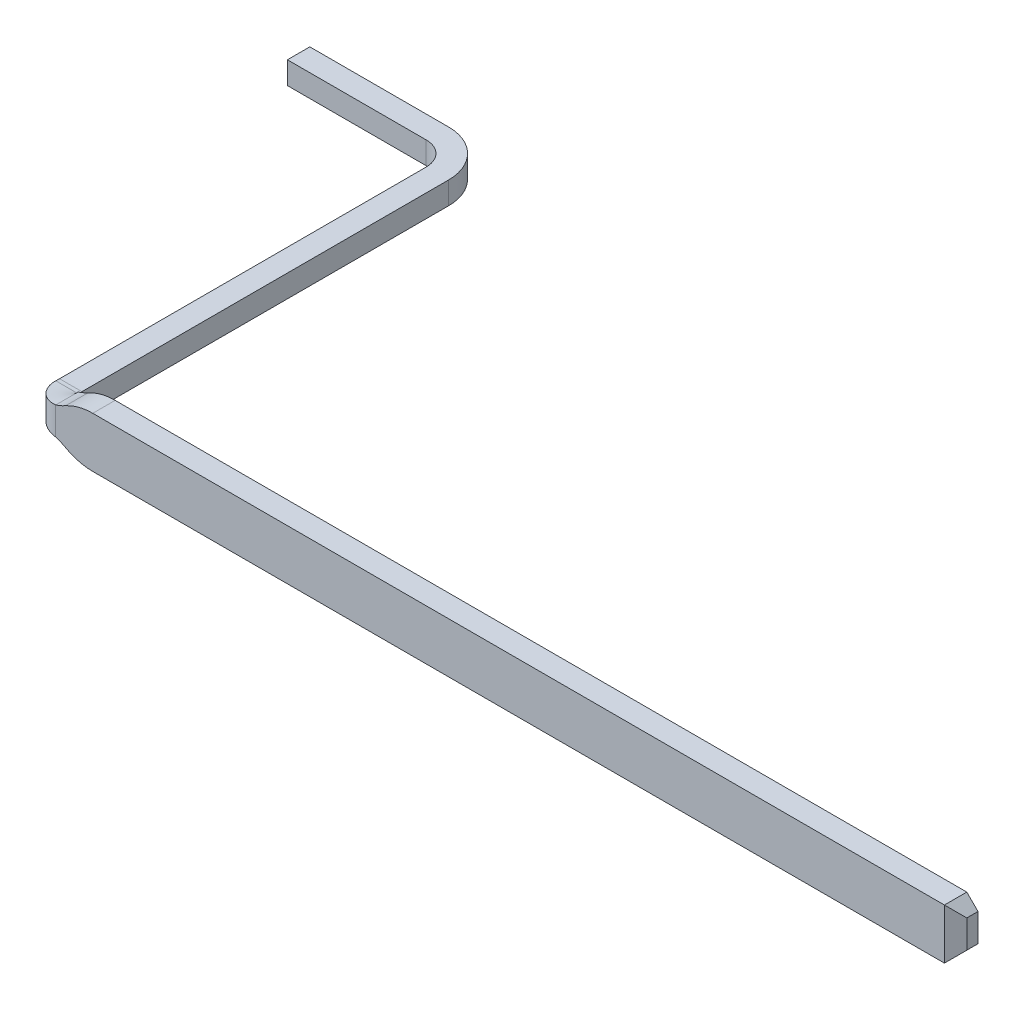
ISO-10303-21;
HEADER;
FILE_DESCRIPTION(('STEP AP214'),'2;1');
FILE_NAME('part.step','',(''),(''),'','','');
FILE_SCHEMA(('AUTOMOTIVE_DESIGN { 1 0 10303 214 1 1 1 1 }'));
ENDSEC;
DATA;
#1=APPLICATION_CONTEXT('core data for automotive mechanical design processes');
#2=APPLICATION_PROTOCOL_DEFINITION('international standard','automotive_design',2000,#1);
#3=PRODUCT_CONTEXT('',#1,'mechanical');
#4=PRODUCT('Part','Part','',(#3));
#5=PRODUCT_RELATED_PRODUCT_CATEGORY('part','',(#4));
#6=PRODUCT_DEFINITION_FORMATION('','',#4);
#7=PRODUCT_DEFINITION_CONTEXT('part definition',#1,'design');
#8=PRODUCT_DEFINITION('design','',#6,#7);
#9=PRODUCT_DEFINITION_SHAPE('','',#8);
#10=(LENGTH_UNIT() NAMED_UNIT(*) SI_UNIT(.MILLI.,.METRE.));
#11=(NAMED_UNIT(*) PLANE_ANGLE_UNIT() SI_UNIT($,.RADIAN.));
#12=(NAMED_UNIT(*) SI_UNIT($,.STERADIAN.) SOLID_ANGLE_UNIT());
#13=UNCERTAINTY_MEASURE_WITH_UNIT(LENGTH_MEASURE(1.E-05),#10,'distance_accuracy_value','');
#14=(GEOMETRIC_REPRESENTATION_CONTEXT(3) GLOBAL_UNCERTAINTY_ASSIGNED_CONTEXT((#13)) GLOBAL_UNIT_ASSIGNED_CONTEXT((#10,
#11,#12)) REPRESENTATION_CONTEXT('',''));
#15=CARTESIAN_POINT('',(0.,0.,0.));
#16=DIRECTION('',(0.,0.,1.));
#17=DIRECTION('',(1.,0.,0.));
#18=AXIS2_PLACEMENT_3D('',#15,#16,#17);
#19=CARTESIAN_POINT('',(-4.44,0.225,-3.52));
#20=DIRECTION('',(0.,1.,0.));
#21=DIRECTION('',(0.,0.,1.));
#22=AXIS2_PLACEMENT_3D('',#19,#20,#21);
#23=CYLINDRICAL_SURFACE('',#22,0.21);
#24=CARTESIAN_POINT('',(-4.44,0.1,-3.52));
#25=DIRECTION('',(0.,1.,0.));
#26=DIRECTION('',(0.,0.,1.));
#27=AXIS2_PLACEMENT_3D('',#24,#25,#26);
#28=CIRCLE('',#27,0.21);
#29=CARTESIAN_POINT('',(-4.44,0.1,-3.73));
#30=VERTEX_POINT('',#29);
#31=CARTESIAN_POINT('',(-4.23,0.1,-3.52));
#32=VERTEX_POINT('',#31);
#33=EDGE_CURVE('E299',#30,#32,#28,.F.);
#34=ORIENTED_EDGE('',*,*,#33,.F.);
#35=DIRECTION('',(0.,1.,0.));
#36=VECTOR('',#35,1.);
#37=CARTESIAN_POINT('',(-4.44,0.225,-3.73));
#38=LINE('',#37,#36);
#39=CARTESIAN_POINT('',(-4.44,-0.1,-3.73));
#40=VERTEX_POINT('',#39);
#41=EDGE_CURVE('E319',#40,#30,#38,.T.);
#42=ORIENTED_EDGE('',*,*,#41,.F.);
#43=CARTESIAN_POINT('',(-4.44,-0.1,-3.52));
#44=DIRECTION('',(0.,1.,0.));
#45=DIRECTION('',(0.,0.,1.));
#46=AXIS2_PLACEMENT_3D('',#43,#44,#45);
#47=CIRCLE('',#46,0.21);
#48=CARTESIAN_POINT('',(-4.23,-0.1,-3.52));
#49=VERTEX_POINT('',#48);
#50=EDGE_CURVE('E306',#40,#49,#47,.F.);
#51=ORIENTED_EDGE('',*,*,#50,.T.);
#52=DIRECTION('',(0.,1.,0.));
#53=VECTOR('',#52,1.);
#54=CARTESIAN_POINT('',(-4.23,0.225,-3.52));
#55=LINE('',#54,#53);
#56=EDGE_CURVE('E188',#32,#49,#55,.F.);
#57=ORIENTED_EDGE('',*,*,#56,.F.);
#58=EDGE_LOOP('',(#34,#42,#51,#57));
#59=FACE_BOUND('',#58,.T.);
#60=ADVANCED_FACE('F16',(#59),#23,.F.);
#61=CARTESIAN_POINT('',(-4.23,0.225,-0.21));
#62=DIRECTION('',(-1.,0.,0.));
#63=DIRECTION('',(0.,0.,1.));
#64=AXIS2_PLACEMENT_3D('',#61,#62,#63);
#65=PLANE('',#64);
#66=DIRECTION('',(0.,0.,1.));
#67=VECTOR('',#66,1.);
#68=CARTESIAN_POINT('',(-4.23,-0.1,-10.4755620374279));
#69=LINE('',#68,#67);
#70=CARTESIAN_POINT('',(-4.23,-0.1,-0.244023483556444));
#71=VERTEX_POINT('',#70);
#72=EDGE_CURVE('E305',#49,#71,#69,.T.);
#73=ORIENTED_EDGE('',*,*,#72,.T.);
#74=CARTESIAN_POINT('',(-4.23,-0.6,-0.244023483556444));
#75=DIRECTION('',(-1.,0.,0.));
#76=DIRECTION('',(0.,0.,1.));
#77=AXIS2_PLACEMENT_3D('',#74,#75,#76);
#78=CIRCLE('',#77,0.5);
#79=CARTESIAN_POINT('',(-4.23,-0.101158940576576,-0.21));
#80=VERTEX_POINT('',#79);
#81=EDGE_CURVE('E161',#71,#80,#78,.F.);
#82=ORIENTED_EDGE('',*,*,#81,.T.);
#83=DIRECTION('',(0.,1.,0.));
#84=VECTOR('',#83,1.);
#85=CARTESIAN_POINT('',(-4.23,0.225,-0.21));
#86=LINE('',#85,#84);
#87=CARTESIAN_POINT('',(-4.23,0.101158940576575,-0.21));
#88=VERTEX_POINT('',#87);
#89=EDGE_CURVE('E154',#80,#88,#86,.T.);
#90=ORIENTED_EDGE('',*,*,#89,.T.);
#91=CARTESIAN_POINT('',(-4.23,0.6,-0.244023483556443));
#92=DIRECTION('',(-1.,0.,0.));
#93=DIRECTION('',(0.,0.,1.));
#94=AXIS2_PLACEMENT_3D('',#91,#92,#93);
#95=CIRCLE('',#94,0.5);
#96=CARTESIAN_POINT('',(-4.23,0.1,-0.244023483556443));
#97=VERTEX_POINT('',#96);
#98=EDGE_CURVE('E23',#88,#97,#95,.F.);
#99=ORIENTED_EDGE('',*,*,#98,.T.);
#100=DIRECTION('',(0.,0.,1.));
#101=VECTOR('',#100,1.);
#102=CARTESIAN_POINT('',(-4.23,0.1,-10.4755620374279));
#103=LINE('',#102,#101);
#104=EDGE_CURVE('E298',#32,#97,#103,.T.);
#105=ORIENTED_EDGE('',*,*,#104,.F.);
#106=ORIENTED_EDGE('',*,*,#56,.T.);
#107=EDGE_LOOP('',(#73,#82,#90,#99,#105,#106));
#108=FACE_BOUND('',#107,.T.);
#109=ADVANCED_FACE('F157',(#108),#65,.T.);
#110=CARTESIAN_POINT('',(-4.44,0.225,-3.93));
#111=DIRECTION('',(0.,0.,1.));
#112=DIRECTION('',(1.,0.,0.));
#113=AXIS2_PLACEMENT_3D('',#110,#111,#112);
#114=PLANE('',#113);
#115=DIRECTION('',(0.,1.,0.));
#116=VECTOR('',#115,1.);
#117=CARTESIAN_POINT('',(-4.44,0.225,-3.93));
#118=LINE('',#117,#116);
#119=CARTESIAN_POINT('',(-4.44,-0.1,-3.93));
#120=VERTEX_POINT('',#119);
#121=CARTESIAN_POINT('',(-4.44,0.1,-3.93));
#122=VERTEX_POINT('',#121);
#123=EDGE_CURVE('E195',#120,#122,#118,.T.);
#124=ORIENTED_EDGE('',*,*,#123,.F.);
#125=DIRECTION('',(1.,0.,0.));
#126=VECTOR('',#125,1.);
#127=CARTESIAN_POINT('',(-4.02,-0.1,-3.93));
#128=LINE('',#127,#126);
#129=CARTESIAN_POINT('',(-5.68,-0.1,-3.93));
#130=VERTEX_POINT('',#129);
#131=EDGE_CURVE('E301',#120,#130,#128,.F.);
#132=ORIENTED_EDGE('',*,*,#131,.T.);
#133=DIRECTION('',(0.,1.,0.));
#134=VECTOR('',#133,1.);
#135=CARTESIAN_POINT('',(-5.68,0.225,-3.93));
#136=LINE('',#135,#134);
#137=CARTESIAN_POINT('',(-5.68,0.1,-3.93));
#138=VERTEX_POINT('',#137);
#139=EDGE_CURVE('E192',#138,#130,#136,.F.);
#140=ORIENTED_EDGE('',*,*,#139,.F.);
#141=DIRECTION('',(1.,0.,0.));
#142=VECTOR('',#141,1.);
#143=CARTESIAN_POINT('',(-4.02,0.1,-3.93));
#144=LINE('',#143,#142);
#145=EDGE_CURVE('E297',#122,#138,#144,.F.);
#146=ORIENTED_EDGE('',*,*,#145,.F.);
#147=EDGE_LOOP('',(#124,#132,#140,#146));
#148=FACE_BOUND('',#147,.T.);
#149=ADVANCED_FACE('F343',(#148),#114,.F.);
#150=CARTESIAN_POINT('',(-5.68,0.225,-3.73));
#151=DIRECTION('',(-1.,0.,0.));
#152=DIRECTION('',(0.,0.,1.));
#153=AXIS2_PLACEMENT_3D('',#150,#151,#152);
#154=PLANE('',#153);
#155=ORIENTED_EDGE('',*,*,#139,.T.);
#156=DIRECTION('',(0.,0.,1.));
#157=VECTOR('',#156,1.);
#158=CARTESIAN_POINT('',(-5.68,-0.1,-10.4755620374279));
#159=LINE('',#158,#157);
#160=CARTESIAN_POINT('',(-5.68,-0.1,-3.73));
#161=VERTEX_POINT('',#160);
#162=EDGE_CURVE('E197',#130,#161,#159,.T.);
#163=ORIENTED_EDGE('',*,*,#162,.T.);
#164=DIRECTION('',(0.,1.,0.));
#165=VECTOR('',#164,1.);
#166=CARTESIAN_POINT('',(-5.68,0.225,-3.73));
#167=LINE('',#166,#165);
#168=CARTESIAN_POINT('',(-5.68,0.1,-3.73));
#169=VERTEX_POINT('',#168);
#170=EDGE_CURVE('E321',#169,#161,#167,.F.);
#171=ORIENTED_EDGE('',*,*,#170,.F.);
#172=DIRECTION('',(0.,0.,1.));
#173=VECTOR('',#172,1.);
#174=CARTESIAN_POINT('',(-5.68,0.1,-10.4755620374279));
#175=LINE('',#174,#173);
#176=EDGE_CURVE('E325',#138,#169,#175,.T.);
#177=ORIENTED_EDGE('',*,*,#176,.F.);
#178=EDGE_LOOP('',(#155,#163,#171,#177));
#179=FACE_BOUND('',#178,.T.);
#180=ADVANCED_FACE('F335',(#179),#154,.T.);
#181=CARTESIAN_POINT('',(-4.44,0.225,-3.73));
#182=DIRECTION('',(0.,0.,1.));
#183=DIRECTION('',(1.,0.,0.));
#184=AXIS2_PLACEMENT_3D('',#181,#182,#183);
#185=PLANE('',#184);
#186=ORIENTED_EDGE('',*,*,#170,.T.);
#187=DIRECTION('',(1.,0.,0.));
#188=VECTOR('',#187,1.);
#189=CARTESIAN_POINT('',(-4.02,-0.1,-3.73));
#190=LINE('',#189,#188);
#191=EDGE_CURVE('E200',#161,#40,#190,.T.);
#192=ORIENTED_EDGE('',*,*,#191,.T.);
#193=ORIENTED_EDGE('',*,*,#41,.T.);
#194=DIRECTION('',(1.,0.,0.));
#195=VECTOR('',#194,1.);
#196=CARTESIAN_POINT('',(-4.02,0.1,-3.73));
#197=LINE('',#196,#195);
#198=EDGE_CURVE('E327',#169,#30,#197,.T.);
#199=ORIENTED_EDGE('',*,*,#198,.F.);
#200=EDGE_LOOP('',(#186,#192,#193,#199));
#201=FACE_BOUND('',#200,.T.);
#202=ADVANCED_FACE('F681',(#201),#185,.T.);
#203=CARTESIAN_POINT('',(-4.44,0.225,-3.52));
#204=DIRECTION('',(0.,1.,0.));
#205=DIRECTION('',(0.,0.,1.));
#206=AXIS2_PLACEMENT_3D('',#203,#204,#205);
#207=CYLINDRICAL_SURFACE('',#206,0.41);
#208=DIRECTION('',(0.,1.,0.));
#209=VECTOR('',#208,1.);
#210=CARTESIAN_POINT('',(-4.03,0.225,-3.52));
#211=LINE('',#210,#209);
#212=CARTESIAN_POINT('',(-4.03,0.1,-3.52));
#213=VERTEX_POINT('',#212);
#214=CARTESIAN_POINT('',(-4.03,-0.1,-3.52));
#215=VERTEX_POINT('',#214);
#216=EDGE_CURVE('E349',#213,#215,#211,.F.);
#217=ORIENTED_EDGE('',*,*,#216,.T.);
#218=CARTESIAN_POINT('',(-4.44,-0.1,-3.52));
#219=DIRECTION('',(0.,1.,0.));
#220=DIRECTION('',(0.,0.,1.));
#221=AXIS2_PLACEMENT_3D('',#218,#219,#220);
#222=CIRCLE('',#221,0.41);
#223=EDGE_CURVE('E302',#215,#120,#222,.T.);
#224=ORIENTED_EDGE('',*,*,#223,.T.);
#225=ORIENTED_EDGE('',*,*,#123,.T.);
#226=CARTESIAN_POINT('',(-4.44,0.1,-3.52));
#227=DIRECTION('',(0.,1.,0.));
#228=DIRECTION('',(0.,0.,1.));
#229=AXIS2_PLACEMENT_3D('',#226,#227,#228);
#230=CIRCLE('',#229,0.41);
#231=EDGE_CURVE('E294',#213,#122,#230,.T.);
#232=ORIENTED_EDGE('',*,*,#231,.F.);
#233=EDGE_LOOP('',(#217,#224,#225,#232));
#234=FACE_BOUND('',#233,.T.);
#235=ADVANCED_FACE('F673',(#234),#207,.T.);
#236=CARTESIAN_POINT('',(-4.02,-0.1,-10.4755620374279));
#237=DIRECTION('',(0.,1.,0.));
#238=DIRECTION('',(0.,0.,1.));
#239=AXIS2_PLACEMENT_3D('',#236,#237,#238);
#240=PLANE('',#239);
#241=ORIENTED_EDGE('',*,*,#223,.F.);
#242=DIRECTION('',(0.,0.,1.));
#243=VECTOR('',#242,1.);
#244=CARTESIAN_POINT('',(-4.03,-0.1,-0.21));
#245=LINE('',#244,#243);
#246=CARTESIAN_POINT('',(-4.03,-0.1,-0.244023483556444));
#247=VERTEX_POINT('',#246);
#248=EDGE_CURVE('E293',#215,#247,#245,.T.);
#249=ORIENTED_EDGE('',*,*,#248,.T.);
#250=DIRECTION('',(1.,0.,0.));
#251=VECTOR('',#250,1.);
#252=CARTESIAN_POINT('',(-4.03,-0.0999999999999999,-0.244023483556444));
#253=LINE('',#252,#251);
#254=EDGE_CURVE('E350',#247,#71,#253,.F.);
#255=ORIENTED_EDGE('',*,*,#254,.T.);
#256=ORIENTED_EDGE('',*,*,#72,.F.);
#257=ORIENTED_EDGE('',*,*,#50,.F.);
#258=ORIENTED_EDGE('',*,*,#191,.F.);
#259=ORIENTED_EDGE('',*,*,#162,.F.);
#260=ORIENTED_EDGE('',*,*,#131,.F.);
#261=EDGE_LOOP('',(#241,#249,#255,#256,#257,#258,#259,#260));
#262=FACE_BOUND('',#261,.T.);
#263=ADVANCED_FACE('F342',(#262),#240,.F.);
#264=CARTESIAN_POINT('',(-4.02,0.1,-10.4755620374279));
#265=DIRECTION('',(0.,1.,0.));
#266=DIRECTION('',(0.,0.,1.));
#267=AXIS2_PLACEMENT_3D('',#264,#265,#266);
#268=PLANE('',#267);
#269=ORIENTED_EDGE('',*,*,#176,.T.);
#270=ORIENTED_EDGE('',*,*,#198,.T.);
#271=ORIENTED_EDGE('',*,*,#33,.T.);
#272=ORIENTED_EDGE('',*,*,#104,.T.);
#273=DIRECTION('',(1.,0.,0.));
#274=VECTOR('',#273,1.);
#275=CARTESIAN_POINT('',(-4.03,0.0999999999999999,-0.244023483556443));
#276=LINE('',#275,#274);
#277=CARTESIAN_POINT('',(-4.03,0.1,-0.244023483556443));
#278=VERTEX_POINT('',#277);
#279=EDGE_CURVE('E187',#97,#278,#276,.T.);
#280=ORIENTED_EDGE('',*,*,#279,.T.);
#281=DIRECTION('',(0.,0.,1.));
#282=VECTOR('',#281,1.);
#283=CARTESIAN_POINT('',(-4.03,0.1,-0.21));
#284=LINE('',#283,#282);
#285=EDGE_CURVE('E175',#278,#213,#284,.F.);
#286=ORIENTED_EDGE('',*,*,#285,.T.);
#287=ORIENTED_EDGE('',*,*,#231,.T.);
#288=ORIENTED_EDGE('',*,*,#145,.T.);
#289=EDGE_LOOP('',(#269,#270,#271,#272,#280,#286,#287,#288));
#290=FACE_BOUND('',#289,.T.);
#291=ADVANCED_FACE('F658',(#290),#268,.T.);
#292=CARTESIAN_POINT('',(-4.03,0.6,-0.244023483556443));
#293=DIRECTION('',(1.,0.,0.));
#294=DIRECTION('',(0.,0.,-1.));
#295=AXIS2_PLACEMENT_3D('',#292,#293,#294);
#296=CYLINDRICAL_SURFACE('',#295,0.5);
#297=DIRECTION('',(1.,0.,0.));
#298=VECTOR('',#297,1.);
#299=CARTESIAN_POINT('',(-4.13,0.101158940576575,-0.21));
#300=LINE('',#299,#298);
#301=CARTESIAN_POINT('',(-4.03,0.101158940576576,-0.21));
#302=VERTEX_POINT('',#301);
#303=EDGE_CURVE('E174',#88,#302,#300,.T.);
#304=ORIENTED_EDGE('',*,*,#303,.T.);
#305=CARTESIAN_POINT('',(-4.03,0.6,-0.244023483556443));
#306=DIRECTION('',(1.,0.,0.));
#307=DIRECTION('',(0.,0.,-1.));
#308=AXIS2_PLACEMENT_3D('',#305,#306,#307);
#309=CIRCLE('',#308,0.5);
#310=EDGE_CURVE('E288',#302,#278,#309,.T.);
#311=ORIENTED_EDGE('',*,*,#310,.T.);
#312=ORIENTED_EDGE('',*,*,#279,.F.);
#313=ORIENTED_EDGE('',*,*,#98,.F.);
#314=EDGE_LOOP('',(#304,#311,#312,#313));
#315=FACE_BOUND('',#314,.T.);
#316=ADVANCED_FACE('F186',(#315),#296,.F.);
#317=CARTESIAN_POINT('',(-4.03,-0.6,-0.244023483556444));
#318=DIRECTION('',(1.,0.,0.));
#319=DIRECTION('',(0.,0.,-1.));
#320=AXIS2_PLACEMENT_3D('',#317,#318,#319);
#321=CYLINDRICAL_SURFACE('',#320,0.5);
#322=ORIENTED_EDGE('',*,*,#81,.F.);
#323=ORIENTED_EDGE('',*,*,#254,.F.);
#324=CARTESIAN_POINT('',(-4.03,-0.6,-0.244023483556444));
#325=DIRECTION('',(1.,0.,0.));
#326=DIRECTION('',(0.,0.,-1.));
#327=AXIS2_PLACEMENT_3D('',#324,#325,#326);
#328=CIRCLE('',#327,0.5);
#329=CARTESIAN_POINT('',(-4.03,-0.101158940576576,-0.21));
#330=VERTEX_POINT('',#329);
#331=EDGE_CURVE('E290',#247,#330,#328,.T.);
#332=ORIENTED_EDGE('',*,*,#331,.T.);
#333=DIRECTION('',(-1.,0.,0.));
#334=VECTOR('',#333,1.);
#335=CARTESIAN_POINT('',(-4.13,-0.101158940576576,-0.21));
#336=LINE('',#335,#334);
#337=EDGE_CURVE('E366',#330,#80,#336,.T.);
#338=ORIENTED_EDGE('',*,*,#337,.T.);
#339=EDGE_LOOP('',(#322,#323,#332,#338));
#340=FACE_BOUND('',#339,.T.);
#341=ADVANCED_FACE('F274',(#340),#321,.F.);
#342=CARTESIAN_POINT('',(-4.02,0.124114287421615,-0.21));
#343=DIRECTION('',(0.,1.,0.));
#344=DIRECTION('',(0.,0.,1.));
#345=AXIS2_PLACEMENT_3D('',#342,#343,#344);
#346=CYLINDRICAL_SURFACE('',#345,0.21);
#347=CARTESIAN_POINT('',(-4.23,-0.101158940576576,-0.21));
#348=CARTESIAN_POINT('',(-4.23000743010832,-0.101432143521485,-0.198933640139197));
#349=CARTESIAN_POINT('',(-4.22912563143157,-0.101753788118606,-0.187871914191268));
#350=CARTESIAN_POINT('',(-4.22564052790241,-0.102494150116234,-0.166029420329182));
#351=CARTESIAN_POINT('',(-4.22303773419751,-0.102912838670037,-0.155248569980906));
#352=CARTESIAN_POINT('',(-4.21593880710557,-0.103878761255174,-0.133532967634879));
#353=CARTESIAN_POINT('',(-4.21132814720644,-0.10443269811771,-0.12263576412296));
#354=CARTESIAN_POINT('',(-4.20034981438912,-0.105653272090144,-0.101774121437816));
#355=CARTESIAN_POINT('',(-4.19398219688327,-0.106319905645467,-0.0918096528605186));
#356=CARTESIAN_POINT('',(-4.17966175840868,-0.107767664053715,-0.0730791725025908));
#357=CARTESIAN_POINT('',(-4.17170659007844,-0.108548957986003,-0.0643149681879857));
#358=CARTESIAN_POINT('',(-4.15444597240556,-0.110227966453596,-0.0482493296178194));
#359=CARTESIAN_POINT('',(-4.14514050700143,-0.111125682373702,-0.0409479127642524));
#360=CARTESIAN_POINT('',(-4.12542290474164,-0.113038908655183,-0.0279958037194465));
#361=CARTESIAN_POINT('',(-4.11500810813162,-0.114054702680234,-0.0223492064102144));
#362=CARTESIAN_POINT('',(-4.09338979990316,-0.116203539406513,-0.0128883413426556));
#363=CARTESIAN_POINT('',(-4.08218658412984,-0.117336538202223,-0.00907339043950609));
#364=CARTESIAN_POINT('',(-4.06245097792108,-0.119396475163932,-0.0041572577298019));
#365=CARTESIAN_POINT('',(-4.05402632869541,-0.120294997774586,-0.00259919323725979));
#366=CARTESIAN_POINT('',(-4.0370675210368,-0.122156058131222,-0.000520226523125556));
#367=CARTESIAN_POINT('',(-4.02853350798701,-0.123118516826998,1.93269818358521E-06));
#368=CARTESIAN_POINT('',(-4.02,-0.124114287421615,0.));
#369=B_SPLINE_CURVE_WITH_KNOTS('',3,(#347,#348,#349,#350,#351,#352,#353,#354,#355,#356,#357,
#358,#359,#360,#361,#362,#363,#364,#365,#366,#367,#368),.UNSPECIFIED.,.F.,.F.,(4,2,2,2,2,2,2,2,
2,2,4),(0.,0.0331684575894302,0.0663270683382791,0.101693505249391,0.137058826872838,
0.172476832553552,0.207895259558179,0.243400604090516,0.27889269597184,0.304675789652125,
0.330427578140949),.UNSPECIFIED.);
#370=CARTESIAN_POINT('',(-4.02,-0.124114287421616,0.));
#371=VERTEX_POINT('',#370);
#372=EDGE_CURVE('E183',#80,#371,#369,.T.);
#373=ORIENTED_EDGE('',*,*,#372,.T.);
#374=DIRECTION('',(0.,1.,0.));
#375=VECTOR('',#374,1.);
#376=CARTESIAN_POINT('',(-4.02,0.225,0.));
#377=LINE('',#376,#375);
#378=CARTESIAN_POINT('',(-4.02,0.124114287421614,0.));
#379=VERTEX_POINT('',#378);
#380=EDGE_CURVE('E170',#379,#371,#377,.F.);
#381=ORIENTED_EDGE('',*,*,#380,.F.);
#382=CARTESIAN_POINT('',(-4.02,0.124114287421615,0.));
#383=CARTESIAN_POINT('',(-4.03190337540096,0.122725056595807,1.07018473565685E-05));
#384=CARTESIAN_POINT('',(-4.04381203209826,0.121400509160792,-0.00101147489141595));
#385=CARTESIAN_POINT('',(-4.06729157703391,0.118877968036939,-0.00505099537595338));
#386=CARTESIAN_POINT('',(-4.0788626933557,0.117679887387664,-0.00806695766416194));
#387=CARTESIAN_POINT('',(-4.10128660398396,0.115410577697545,-0.016006061210853));
#388=CARTESIAN_POINT('',(-4.11214234585603,0.114338811635387,-0.0209207180855486));
#389=CARTESIAN_POINT('',(-4.13287400195197,0.112312711813778,-0.0325164671303216));
#390=CARTESIAN_POINT('',(-4.14275015617343,0.111358349276795,-0.0391971251552287));
#391=CARTESIAN_POINT('',(-4.16120450981132,0.109571715171886,-0.0541104569130387));
#392=CARTESIAN_POINT('',(-4.16978727266918,0.108739014679495,-0.0623374322847382));
#393=CARTESIAN_POINT('',(-4.18544825589962,0.107188897709081,-0.080125972775488));
#394=CARTESIAN_POINT('',(-4.1925265397612,0.106471476366591,-0.0896874815490359));
#395=CARTESIAN_POINT('',(-4.20495645643552,0.105153273163319,-0.109845042283391));
#396=CARTESIAN_POINT('',(-4.21031254771358,0.104552191752345,-0.120438328872899));
#397=CARTESIAN_POINT('',(-4.21916536312806,0.103462342252806,-0.142377202368875));
#398=CARTESIAN_POINT('',(-4.2226633142977,0.102973500167788,-0.153722287239162));
#399=CARTESIAN_POINT('',(-4.22678339685296,0.10226512308797,-0.172619901633766));
#400=CARTESIAN_POINT('',(-4.22798890782219,0.102012341979516,-0.180049121666497));
#401=CARTESIAN_POINT('',(-4.22959701992659,0.101551985369659,-0.19498430284126));
#402=CARTESIAN_POINT('',(-4.23000079390623,0.101344344230797,-0.2024901357152));
#403=CARTESIAN_POINT('',(-4.23,0.101158940576575,-0.21));
#404=B_SPLINE_CURVE_WITH_KNOTS('',3,(#382,#383,#384,#385,#386,#387,#388,#389,#390,#391,#392,
#393,#394,#395,#396,#397,#398,#399,#400,#401,#402,#403),.UNSPECIFIED.,.F.,.F.,(4,2,2,2,2,2,2,2,
2,2,4),(0.,0.035905666971063,0.0717864816006473,0.107508782224781,0.143222309205243,
0.178806720179375,0.214389629193847,0.249879664203142,0.285346233943266,0.307898040963291,
0.330416833033264),.UNSPECIFIED.);
#405=EDGE_CURVE('E167',#379,#88,#404,.T.);
#406=ORIENTED_EDGE('',*,*,#405,.T.);
#407=ORIENTED_EDGE('',*,*,#89,.F.);
#408=EDGE_LOOP('',(#373,#381,#406,#407));
#409=FACE_BOUND('',#408,.T.);
#410=ADVANCED_FACE('F169',(#409),#346,.T.);
#411=CARTESIAN_POINT('',(-4.03,0.225,-0.21));
#412=DIRECTION('',(-1.,0.,0.));
#413=DIRECTION('',(0.,0.,1.));
#414=AXIS2_PLACEMENT_3D('',#411,#412,#413);
#415=PLANE('',#414);
#416=ORIENTED_EDGE('',*,*,#310,.F.);
#417=DIRECTION('',(0.,1.,0.));
#418=VECTOR('',#417,1.);
#419=CARTESIAN_POINT('',(-4.03,0.124114287421615,-0.21));
#420=LINE('',#419,#418);
#421=EDGE_CURVE('E405',#302,#330,#420,.F.);
#422=ORIENTED_EDGE('',*,*,#421,.T.);
#423=ORIENTED_EDGE('',*,*,#331,.F.);
#424=ORIENTED_EDGE('',*,*,#248,.F.);
#425=ORIENTED_EDGE('',*,*,#216,.F.);
#426=ORIENTED_EDGE('',*,*,#285,.F.);
#427=EDGE_LOOP('',(#416,#422,#423,#424,#425,#426));
#428=FACE_BOUND('',#427,.T.);
#429=ADVANCED_FACE('F267',(#428),#415,.F.);
#430=CARTESIAN_POINT('',(-4.23202,0.101158940576575,-0.21));
#431=CARTESIAN_POINT('',(-4.23202,0.102546659833655,-0.153239739674804));
#432=CARTESIAN_POINT('',(-4.20824043701283,0.105159533267918,-0.0976865496137367));
#433=CARTESIAN_POINT('',(-4.12882573797228,0.112830289181848,-0.0197219612797117));
#434=CARTESIAN_POINT('',(-4.07400092677609,0.117874406004369,0.00201999999999993));
#435=CARTESIAN_POINT('',(-4.02,0.124114287421615,0.00202));
#436=CARTESIAN_POINT('',(-4.23,0.101158940576575,-0.21));
#437=CARTESIAN_POINT('',(-4.23,0.102546646790206,-0.153780542476827));
#438=CARTESIAN_POINT('',(-4.20644699449436,0.105159533267918,-0.098756605126331));
#439=CARTESIAN_POINT('',(-4.12778891130166,0.112830289181848,-0.0215348168509549));
#440=CARTESIAN_POINT('',(-4.07348641177817,0.117874471308925,0.));
#441=CARTESIAN_POINT('',(-4.02,0.124114287421615,0.));
#442=CARTESIAN_POINT('',(-4.03,0.101158940576575,-0.21));
#443=CARTESIAN_POINT('',(-4.03,0.102545355359649,-0.207325374360293));
#444=CARTESIAN_POINT('',(-4.02887842830925,0.105159533267918,-0.204702695482207));
#445=CARTESIAN_POINT('',(-4.02513280530008,0.112830289181848,-0.201025467469093));
#446=CARTESIAN_POINT('',(-4.02254433277619,0.117880937106508,-0.2));
#447=CARTESIAN_POINT('',(-4.02,0.124114287421615,-0.2));
#448=CARTESIAN_POINT('',(-4.028,0.101158940576575,-0.21));
#449=CARTESIAN_POINT('',(-4.028,0.102545342445343,-0.207860822679128));
#450=CARTESIAN_POINT('',(-4.0271027426474,0.105159533267918,-0.205762156385766));
#451=CARTESIAN_POINT('',(-4.02410624424006,0.112830289181848,-0.202820373975274));
#452=CARTESIAN_POINT('',(-4.02203491198617,0.117881001764484,-0.202));
#453=CARTESIAN_POINT('',(-4.02,0.124114287421615,-0.202));
#454=B_SPLINE_SURFACE_WITH_KNOTS('',1,3,((#430,#431,#432,#433,#434,#435),(#436,#437,#438,#439,
#440,#441),(#442,#443,#444,#445,#446,#447),(#448,#449,#450,#451,#452,#453)),.UNSPECIFIED.,.F.,
.F.,.F.,(2,1,1,2),(4,2,4),(-0.0101,0.,1.,1.01),(4.78048857121855,4.90235751287474,
5.02422645453093),.UNSPECIFIED.);
#455=CARTESIAN_POINT('',(-4.02,0.124114287421615,-0.2));
#456=CARTESIAN_POINT('',(-4.02085662865134,0.121995186733768,-0.200007568679163));
#457=CARTESIAN_POINT('',(-4.02178641422411,0.119887550096803,-0.200113479961398));
#458=CARTESIAN_POINT('',(-4.02371982760732,0.115708139988861,-0.200659361459678));
#459=CARTESIAN_POINT('',(-4.02472447236866,0.113637664937403,-0.201105221318472));
#460=CARTESIAN_POINT('',(-4.02664864629132,0.109725298998943,-0.202443179843877));
#461=CARTESIAN_POINT('',(-4.02756991402892,0.107877147686326,-0.203311677121211));
#462=CARTESIAN_POINT('',(-4.02889488171605,0.104976098905077,-0.205325776933997));
#463=CARTESIAN_POINT('',(-4.02937060540025,0.103853531185739,-0.206303772375835));
#464=CARTESIAN_POINT('',(-4.0298708360797,0.102230685837629,-0.208222653476669));
#465=CARTESIAN_POINT('',(-4.02999211124695,0.10164702604904,-0.209070714091166));
#466=CARTESIAN_POINT('',(-4.03,0.101158940576575,-0.21));
#467=B_SPLINE_CURVE_WITH_KNOTS('',3,(#455,#456,#457,#458,#459,#460,#461,#462,#463,#464,#465,
#466),.UNSPECIFIED.,.F.,.F.,(4,2,2,2,2,4),(0.,0.00688086146012702,0.0138837220807244,
0.0205339465220933,0.0251369702778051,0.0282318755787238),.UNSPECIFIED.);
#468=CARTESIAN_POINT('',(-4.02,0.124114287421614,-0.2));
#469=VERTEX_POINT('',#468);
#470=EDGE_CURVE('E180',#469,#302,#467,.T.);
#471=DIRECTION('',(0.,0.,-1.));
#472=VECTOR('',#471,1.);
#473=CARTESIAN_POINT('',(-4.02,0.124114287421614,-0.2));
#474=LINE('',#473,#472);
#475=EDGE_CURVE('E403',#379,#469,#474,.T.);
#476=ORIENTED_EDGE('',*,*,#470,.T.);
#477=ORIENTED_EDGE('',*,*,#303,.F.);
#478=ORIENTED_EDGE('',*,*,#405,.F.);
#479=ORIENTED_EDGE('',*,*,#475,.T.);
#480=EDGE_LOOP('',(#476,#477,#478,#479));
#481=FACE_BOUND('',#480,.T.);
#482=ADVANCED_FACE('F179',(#481),#454,.F.);
#483=CARTESIAN_POINT('',(-4.02,-0.124114287421615,0.00202));
#484=CARTESIAN_POINT('',(-4.07400092677608,-0.117874406004369,0.00201999999999998));
#485=CARTESIAN_POINT('',(-4.12882573797228,-0.112830289181849,-0.0197219612797102));
#486=CARTESIAN_POINT('',(-4.20824043701283,-0.105159533267918,-0.0976865496137339));
#487=CARTESIAN_POINT('',(-4.23202,-0.102546659833655,-0.153239739674803));
#488=CARTESIAN_POINT('',(-4.23202,-0.101158940576576,-0.21));
#489=CARTESIAN_POINT('',(-4.02,-0.124114287421615,0.));
#490=CARTESIAN_POINT('',(-4.07348641177816,-0.117874471308925,0.));
#491=CARTESIAN_POINT('',(-4.12778891130166,-0.112830289181849,-0.0215348168509534));
#492=CARTESIAN_POINT('',(-4.20644699449436,-0.105159533267918,-0.0987566051263283));
#493=CARTESIAN_POINT('',(-4.23,-0.102546646790206,-0.153780542476826));
#494=CARTESIAN_POINT('',(-4.23,-0.101158940576576,-0.21));
#495=CARTESIAN_POINT('',(-4.02,-0.124114287421615,-0.2));
#496=CARTESIAN_POINT('',(-4.02254433277619,-0.117880937106508,-0.2));
#497=CARTESIAN_POINT('',(-4.02513280530008,-0.112830289181849,-0.201025467469093));
#498=CARTESIAN_POINT('',(-4.02887842830925,-0.105159533267918,-0.204702695482207));
#499=CARTESIAN_POINT('',(-4.03,-0.102545355359649,-0.207325374360293));
#500=CARTESIAN_POINT('',(-4.03,-0.101158940576576,-0.21));
#501=CARTESIAN_POINT('',(-4.02,-0.124114287421615,-0.202));
#502=CARTESIAN_POINT('',(-4.02203491198617,-0.117881001764484,-0.202));
#503=CARTESIAN_POINT('',(-4.02410624424006,-0.112830289181849,-0.202820373975274));
#504=CARTESIAN_POINT('',(-4.0271027426474,-0.105159533267918,-0.205762156385766));
#505=CARTESIAN_POINT('',(-4.028,-0.102545342445343,-0.207860822679128));
#506=CARTESIAN_POINT('',(-4.028,-0.101158940576576,-0.21));
#507=B_SPLINE_SURFACE_WITH_KNOTS('',1,3,((#483,#484,#485,#486,#487,#488),(#489,#490,#491,#492,
#493,#494),(#495,#496,#497,#498,#499,#500),(#501,#502,#503,#504,#505,#506)),.UNSPECIFIED.,.F.,
.F.,.F.,(2,1,1,2),(4,2,4),(-0.0101,0.,1.,1.01),(1.25895885264865,1.38082779430484,
1.50269673596104),.UNSPECIFIED.);
#508=CARTESIAN_POINT('',(-4.03,-0.101158940576576,-0.21));
#509=CARTESIAN_POINT('',(-4.02998180998836,-0.101780615773462,-0.208828718818235));
#510=CARTESIAN_POINT('',(-4.02979598705017,-0.102540510662379,-0.207792425053747));
#511=CARTESIAN_POINT('',(-4.02908418914379,-0.10459425837617,-0.205592237903467));
#512=CARTESIAN_POINT('',(-4.02845158678957,-0.10597999398299,-0.204544208307881));
#513=CARTESIAN_POINT('',(-4.02658757347885,-0.109894510925843,-0.202249088426792));
#514=CARTESIAN_POINT('',(-4.025244442235,-0.112551472049058,-0.20136486528882));
#515=CARTESIAN_POINT('',(-4.02324679134848,-0.116722178904259,-0.200513445244303));
#516=CARTESIAN_POINT('',(-4.02256383908056,-0.118189815791255,-0.200310800059921));
#517=CARTESIAN_POINT('',(-4.02124506121451,-0.121139111708642,-0.200055242579584));
#518=CARTESIAN_POINT('',(-4.02060878372263,-0.122620414997679,-0.20000063396611));
#519=CARTESIAN_POINT('',(-4.02,-0.124114287421615,-0.2));
#520=B_SPLINE_CURVE_WITH_KNOTS('',3,(#508,#509,#510,#511,#512,#513,#514,#515,#516,#517,#518,
#519),.UNSPECIFIED.,.F.,.F.,(4,2,2,2,2,4),(0.,0.00387441254926356,0.00930463351604767,
0.0184871539699757,0.023377759851906,0.0282120836784113),.UNSPECIFIED.);
#521=CARTESIAN_POINT('',(-4.02,-0.124114287421616,-0.2));
#522=VERTEX_POINT('',#521);
#523=EDGE_CURVE('E232',#330,#522,#520,.T.);
#524=DIRECTION('',(0.,0.,-1.));
#525=VECTOR('',#524,1.);
#526=CARTESIAN_POINT('',(-4.02,-0.124114287421617,-0.2));
#527=LINE('',#526,#525);
#528=EDGE_CURVE('E225',#522,#371,#527,.F.);
#529=ORIENTED_EDGE('',*,*,#523,.T.);
#530=ORIENTED_EDGE('',*,*,#528,.T.);
#531=ORIENTED_EDGE('',*,*,#372,.F.);
#532=ORIENTED_EDGE('',*,*,#337,.F.);
#533=EDGE_LOOP('',(#529,#530,#531,#532));
#534=FACE_BOUND('',#533,.T.);
#535=ADVANCED_FACE('F18',(#534),#507,.F.);
#536=CARTESIAN_POINT('',(4.02,0.225,-0.1));
#537=DIRECTION('',(0.707106781186547,0.,0.707106781186548));
#538=DIRECTION('',(0.707106781186548,0.,-0.707106781186547));
#539=AXIS2_PLACEMENT_3D('',#536,#537,#538);
#540=PLANE('',#539);
#541=DIRECTION('',(0.577350269189626,0.577350269189627,-0.577350269189624));
#542=VECTOR('',#541,1.);
#543=CARTESIAN_POINT('',(3.92,-0.225,0.));
#544=LINE('',#543,#542);
#545=CARTESIAN_POINT('',(3.92,-0.225,0.));
#546=VERTEX_POINT('',#545);
#547=CARTESIAN_POINT('',(4.02,-0.125,-0.1));
#548=VERTEX_POINT('',#547);
#549=EDGE_CURVE('E377',#546,#548,#544,.T.);
#550=ORIENTED_EDGE('',*,*,#549,.T.);
#551=DIRECTION('',(0.,1.,0.));
#552=VECTOR('',#551,1.);
#553=CARTESIAN_POINT('',(4.02,0.225,-0.1));
#554=LINE('',#553,#552);
#555=CARTESIAN_POINT('',(4.02,0.125,-0.1));
#556=VERTEX_POINT('',#555);
#557=EDGE_CURVE('E382',#548,#556,#554,.T.);
#558=ORIENTED_EDGE('',*,*,#557,.T.);
#559=DIRECTION('',(0.577350269189625,-0.577350269189629,-0.577350269189623));
#560=VECTOR('',#559,1.);
#561=CARTESIAN_POINT('',(3.92,0.225,0.));
#562=LINE('',#561,#560);
#563=CARTESIAN_POINT('',(3.92,0.225,0.));
#564=VERTEX_POINT('',#563);
#565=EDGE_CURVE('E385',#564,#556,#562,.T.);
#566=ORIENTED_EDGE('',*,*,#565,.F.);
#567=DIRECTION('',(0.,1.,0.));
#568=VECTOR('',#567,1.);
#569=CARTESIAN_POINT('',(3.92,0.225,0.));
#570=LINE('',#569,#568);
#571=EDGE_CURVE('E367',#546,#564,#570,.T.);
#572=ORIENTED_EDGE('',*,*,#571,.F.);
#573=EDGE_LOOP('',(#550,#558,#566,#572));
#574=FACE_BOUND('',#573,.T.);
#575=ADVANCED_FACE('F262',(#574),#540,.T.);
#576=CARTESIAN_POINT('',(4.02,0.225,0.));
#577=DIRECTION('',(0.,0.,1.));
#578=DIRECTION('',(1.,0.,0.));
#579=AXIS2_PLACEMENT_3D('',#576,#577,#578);
#580=PLANE('',#579);
#581=CARTESIAN_POINT('',(-4.17340400439286,-0.6,0.));
#582=DIRECTION('',(0.,0.,-1.));
#583=DIRECTION('',(-1.,0.,0.));
#584=AXIS2_PLACEMENT_3D('',#581,#582,#583);
#585=CIRCLE('',#584,0.5);
#586=CARTESIAN_POINT('',(-3.93134254525489,-0.162500000000001,0.));
#587=VERTEX_POINT('',#586);
#588=EDGE_CURVE('E223',#371,#587,#585,.T.);
#589=ORIENTED_EDGE('',*,*,#588,.T.);
#590=CARTESIAN_POINT('',(-3.68928108611693,0.275,0.));
#591=DIRECTION('',(0.,0.,-1.));
#592=DIRECTION('',(-1.,0.,0.));
#593=AXIS2_PLACEMENT_3D('',#590,#591,#592);
#594=CIRCLE('',#593,0.5);
#595=CARTESIAN_POINT('',(-3.68928108611693,-0.225,0.));
#596=VERTEX_POINT('',#595);
#597=EDGE_CURVE('E218',#596,#587,#594,.T.);
#598=ORIENTED_EDGE('',*,*,#597,.F.);
#599=DIRECTION('',(1.,0.,0.));
#600=VECTOR('',#599,1.);
#601=CARTESIAN_POINT('',(4.02,-0.225,0.));
#602=LINE('',#601,#600);
#603=EDGE_CURVE('E371',#596,#546,#602,.T.);
#604=ORIENTED_EDGE('',*,*,#603,.T.);
#605=ORIENTED_EDGE('',*,*,#571,.T.);
#606=DIRECTION('',(1.,0.,0.));
#607=VECTOR('',#606,1.);
#608=CARTESIAN_POINT('',(-4.44,0.225,0.));
#609=LINE('',#608,#607);
#610=CARTESIAN_POINT('',(-3.68928108611693,0.225,0.));
#611=VERTEX_POINT('',#610);
#612=EDGE_CURVE('E397',#611,#564,#609,.T.);
#613=ORIENTED_EDGE('',*,*,#612,.F.);
#614=CARTESIAN_POINT('',(-3.68928108611693,-0.275,0.));
#615=DIRECTION('',(0.,0.,1.));
#616=DIRECTION('',(1.,0.,0.));
#617=AXIS2_PLACEMENT_3D('',#614,#615,#616);
#618=CIRCLE('',#617,0.5);
#619=CARTESIAN_POINT('',(-3.93134254525489,0.1625,0.));
#620=VERTEX_POINT('',#619);
#621=EDGE_CURVE('E390',#620,#611,#618,.F.);
#622=ORIENTED_EDGE('',*,*,#621,.F.);
#623=CARTESIAN_POINT('',(-4.17340400439285,0.6,0.));
#624=DIRECTION('',(0.,0.,-1.));
#625=DIRECTION('',(-1.,0.,0.));
#626=AXIS2_PLACEMENT_3D('',#623,#624,#625);
#627=CIRCLE('',#626,0.5);
#628=EDGE_CURVE('E402',#620,#379,#627,.T.);
#629=ORIENTED_EDGE('',*,*,#628,.T.);
#630=ORIENTED_EDGE('',*,*,#380,.T.);
#631=EDGE_LOOP('',(#589,#598,#604,#605,#613,#622,#629,#630));
#632=FACE_BOUND('',#631,.T.);
#633=ADVANCED_FACE('F258',(#632),#580,.T.);
#634=CARTESIAN_POINT('',(-3.68928108611693,-0.275,-10.4755620374279));
#635=DIRECTION('',(0.,0.,1.));
#636=DIRECTION('',(1.,0.,0.));
#637=AXIS2_PLACEMENT_3D('',#634,#635,#636);
#638=CYLINDRICAL_SURFACE('',#637,0.5);
#639=ORIENTED_EDGE('',*,*,#621,.T.);
#640=DIRECTION('',(0.,0.,1.));
#641=VECTOR('',#640,1.);
#642=CARTESIAN_POINT('',(-3.68928108611693,0.225,-3.73));
#643=LINE('',#642,#641);
#644=CARTESIAN_POINT('',(-3.68928108611693,0.225,-0.2));
#645=VERTEX_POINT('',#644);
#646=EDGE_CURVE('E217',#645,#611,#643,.T.);
#647=ORIENTED_EDGE('',*,*,#646,.F.);
#648=CARTESIAN_POINT('',(-3.68928108611693,-0.275,-0.200000000000001));
#649=DIRECTION('',(0.,0.,1.));
#650=DIRECTION('',(1.,0.,0.));
#651=AXIS2_PLACEMENT_3D('',#648,#649,#650);
#652=CIRCLE('',#651,0.5);
#653=CARTESIAN_POINT('',(-3.93134254525489,0.162499999999999,-0.2));
#654=VERTEX_POINT('',#653);
#655=EDGE_CURVE('E214',#645,#654,#652,.T.);
#656=ORIENTED_EDGE('',*,*,#655,.T.);
#657=DIRECTION('',(0.,0.,-1.));
#658=VECTOR('',#657,1.);
#659=CARTESIAN_POINT('',(-3.93134254525489,0.162499999999999,-0.2));
#660=LINE('',#659,#658);
#661=EDGE_CURVE('E399',#654,#620,#660,.F.);
#662=ORIENTED_EDGE('',*,*,#661,.T.);
#663=EDGE_LOOP('',(#639,#647,#656,#662));
#664=FACE_BOUND('',#663,.T.);
#665=ADVANCED_FACE('F254',(#664),#638,.T.);
#666=CARTESIAN_POINT('',(-4.17340400439285,0.6,-0.2));
#667=DIRECTION('',(0.,0.,-1.));
#668=DIRECTION('',(-1.,0.,0.));
#669=AXIS2_PLACEMENT_3D('',#666,#667,#668);
#670=CYLINDRICAL_SURFACE('',#669,0.5);
#671=ORIENTED_EDGE('',*,*,#628,.F.);
#672=ORIENTED_EDGE('',*,*,#661,.F.);
#673=CARTESIAN_POINT('',(-4.17340400439285,0.6,-0.2));
#674=DIRECTION('',(0.,0.,-1.));
#675=DIRECTION('',(-1.,0.,0.));
#676=AXIS2_PLACEMENT_3D('',#673,#674,#675);
#677=CIRCLE('',#676,0.5);
#678=EDGE_CURVE('E211',#654,#469,#677,.T.);
#679=ORIENTED_EDGE('',*,*,#678,.T.);
#680=ORIENTED_EDGE('',*,*,#475,.F.);
#681=EDGE_LOOP('',(#671,#672,#679,#680));
#682=FACE_BOUND('',#681,.T.);
#683=ADVANCED_FACE('F248',(#682),#670,.F.);
#684=CARTESIAN_POINT('',(-4.02,0.124114287421615,-0.21));
#685=DIRECTION('',(0.,1.,0.));
#686=DIRECTION('',(0.,0.,1.));
#687=AXIS2_PLACEMENT_3D('',#684,#685,#686);
#688=CYLINDRICAL_SURFACE('',#687,0.01);
#689=DIRECTION('',(0.,1.,0.));
#690=VECTOR('',#689,1.);
#691=CARTESIAN_POINT('',(-4.02,0.225,-0.2));
#692=LINE('',#691,#690);
#693=EDGE_CURVE('E210',#469,#522,#692,.F.);
#694=ORIENTED_EDGE('',*,*,#693,.T.);
#695=ORIENTED_EDGE('',*,*,#523,.F.);
#696=ORIENTED_EDGE('',*,*,#421,.F.);
#697=ORIENTED_EDGE('',*,*,#470,.F.);
#698=EDGE_LOOP('',(#694,#695,#696,#697));
#699=FACE_BOUND('',#698,.T.);
#700=ADVANCED_FACE('F242',(#699),#688,.F.);
#701=CARTESIAN_POINT('',(-4.17340400439286,-0.6,-0.2));
#702=DIRECTION('',(0.,0.,-1.));
#703=DIRECTION('',(-1.,0.,0.));
#704=AXIS2_PLACEMENT_3D('',#701,#702,#703);
#705=CYLINDRICAL_SURFACE('',#704,0.5);
#706=ORIENTED_EDGE('',*,*,#528,.F.);
#707=CARTESIAN_POINT('',(-4.17340400439286,-0.6,-0.2));
#708=DIRECTION('',(0.,0.,-1.));
#709=DIRECTION('',(-1.,0.,0.));
#710=AXIS2_PLACEMENT_3D('',#707,#708,#709);
#711=CIRCLE('',#710,0.5);
#712=CARTESIAN_POINT('',(-3.93134254525489,-0.162500000000001,-0.2));
#713=VERTEX_POINT('',#712);
#714=EDGE_CURVE('E207',#522,#713,#711,.T.);
#715=ORIENTED_EDGE('',*,*,#714,.T.);
#716=DIRECTION('',(0.,0.,-1.));
#717=VECTOR('',#716,1.);
#718=CARTESIAN_POINT('',(-3.93134254525489,-0.162500000000002,-10.4755620374279));
#719=LINE('',#718,#717);
#720=EDGE_CURVE('E222',#587,#713,#719,.T.);
#721=ORIENTED_EDGE('',*,*,#720,.F.);
#722=ORIENTED_EDGE('',*,*,#588,.F.);
#723=EDGE_LOOP('',(#706,#715,#721,#722));
#724=FACE_BOUND('',#723,.T.);
#725=ADVANCED_FACE('F247',(#724),#705,.F.);
#726=CARTESIAN_POINT('',(-3.68928108611693,0.275,-10.4755620374279));
#727=DIRECTION('',(0.,0.,-1.));
#728=DIRECTION('',(-1.,0.,0.));
#729=AXIS2_PLACEMENT_3D('',#726,#727,#728);
#730=CYLINDRICAL_SURFACE('',#729,0.5);
#731=DIRECTION('',(0.,0.,1.));
#732=VECTOR('',#731,1.);
#733=CARTESIAN_POINT('',(-3.68928108611693,-0.225,0.));
#734=LINE('',#733,#732);
#735=CARTESIAN_POINT('',(-3.68928108611693,-0.225,-0.2));
#736=VERTEX_POINT('',#735);
#737=EDGE_CURVE('E221',#736,#596,#734,.T.);
#738=ORIENTED_EDGE('',*,*,#737,.T.);
#739=ORIENTED_EDGE('',*,*,#597,.T.);
#740=ORIENTED_EDGE('',*,*,#720,.T.);
#741=CARTESIAN_POINT('',(-3.68928108611693,0.275,-0.200000000000001));
#742=DIRECTION('',(0.,0.,-1.));
#743=DIRECTION('',(-1.,0.,0.));
#744=AXIS2_PLACEMENT_3D('',#741,#742,#743);
#745=CIRCLE('',#744,0.5);
#746=EDGE_CURVE('E203',#713,#736,#745,.F.);
#747=ORIENTED_EDGE('',*,*,#746,.T.);
#748=EDGE_LOOP('',(#738,#739,#740,#747));
#749=FACE_BOUND('',#748,.T.);
#750=ADVANCED_FACE('F462',(#749),#730,.T.);
#751=CARTESIAN_POINT('',(4.02,-0.225,0.));
#752=DIRECTION('',(0.,1.,0.));
#753=DIRECTION('',(0.,0.,1.));
#754=AXIS2_PLACEMENT_3D('',#751,#752,#753);
#755=PLANE('',#754);
#756=DIRECTION('',(0.,0.,1.));
#757=VECTOR('',#756,1.);
#758=CARTESIAN_POINT('',(3.92,-0.225,0.));
#759=LINE('',#758,#757);
#760=CARTESIAN_POINT('',(3.92,-0.225,-0.2));
#761=VERTEX_POINT('',#760);
#762=EDGE_CURVE('E374',#761,#546,#759,.T.);
#763=ORIENTED_EDGE('',*,*,#762,.T.);
#764=ORIENTED_EDGE('',*,*,#603,.F.);
#765=ORIENTED_EDGE('',*,*,#737,.F.);
#766=DIRECTION('',(1.,0.,0.));
#767=VECTOR('',#766,1.);
#768=CARTESIAN_POINT('',(4.02,-0.225,-0.2));
#769=LINE('',#768,#767);
#770=EDGE_CURVE('E206',#736,#761,#769,.T.);
#771=ORIENTED_EDGE('',*,*,#770,.T.);
#772=EDGE_LOOP('',(#763,#764,#765,#771));
#773=FACE_BOUND('',#772,.T.);
#774=ADVANCED_FACE('F452',(#773),#755,.F.);
#775=CARTESIAN_POINT('',(3.92,-0.225,0.));
#776=DIRECTION('',(-0.707106781186547,0.707106781186548,0.));
#777=DIRECTION('',(-0.707106781186548,-0.707106781186547,0.));
#778=AXIS2_PLACEMENT_3D('',#775,#776,#777);
#779=PLANE('',#778);
#780=ORIENTED_EDGE('',*,*,#549,.F.);
#781=ORIENTED_EDGE('',*,*,#762,.F.);
#782=DIRECTION('',(0.707106781186545,0.70710678118655,0.));
#783=VECTOR('',#782,1.);
#784=CARTESIAN_POINT('',(3.92,-0.225,-0.2));
#785=LINE('',#784,#783);
#786=CARTESIAN_POINT('',(4.02,-0.125,-0.2));
#787=VERTEX_POINT('',#786);
#788=EDGE_CURVE('E419',#761,#787,#785,.T.);
#789=ORIENTED_EDGE('',*,*,#788,.T.);
#790=DIRECTION('',(0.,0.,1.));
#791=VECTOR('',#790,1.);
#792=CARTESIAN_POINT('',(4.02,-0.125,0.));
#793=LINE('',#792,#791);
#794=EDGE_CURVE('E379',#787,#548,#793,.T.);
#795=ORIENTED_EDGE('',*,*,#794,.T.);
#796=EDGE_LOOP('',(#780,#781,#789,#795));
#797=FACE_BOUND('',#796,.T.);
#798=ADVANCED_FACE('F485',(#797),#779,.F.);
#799=CARTESIAN_POINT('',(4.02,0.225,0.));
#800=DIRECTION('',(-1.,0.,0.));
#801=DIRECTION('',(0.,0.,1.));
#802=AXIS2_PLACEMENT_3D('',#799,#800,#801);
#803=PLANE('',#802);
#804=ORIENTED_EDGE('',*,*,#557,.F.);
#805=ORIENTED_EDGE('',*,*,#794,.F.);
#806=DIRECTION('',(0.,1.,0.));
#807=VECTOR('',#806,1.);
#808=CARTESIAN_POINT('',(4.02,0.225,-0.2));
#809=LINE('',#808,#807);
#810=CARTESIAN_POINT('',(4.02,0.125,-0.2));
#811=VERTEX_POINT('',#810);
#812=EDGE_CURVE('E422',#787,#811,#809,.T.);
#813=ORIENTED_EDGE('',*,*,#812,.T.);
#814=DIRECTION('',(0.,0.,1.));
#815=VECTOR('',#814,1.);
#816=CARTESIAN_POINT('',(4.02,0.125,0.));
#817=LINE('',#816,#815);
#818=EDGE_CURVE('E394',#556,#811,#817,.F.);
#819=ORIENTED_EDGE('',*,*,#818,.F.);
#820=EDGE_LOOP('',(#804,#805,#813,#819));
#821=FACE_BOUND('',#820,.T.);
#822=ADVANCED_FACE('F483',(#821),#803,.F.);
#823=CARTESIAN_POINT('',(4.02,0.125,0.));
#824=DIRECTION('',(0.70710678118655,0.707106781186546,0.));
#825=DIRECTION('',(-0.707106781186546,0.70710678118655,0.));
#826=AXIS2_PLACEMENT_3D('',#823,#824,#825);
#827=PLANE('',#826);
#828=ORIENTED_EDGE('',*,*,#818,.T.);
#829=DIRECTION('',(-0.707106781186545,0.70710678118655,0.));
#830=VECTOR('',#829,1.);
#831=CARTESIAN_POINT('',(4.02,0.125,-0.2));
#832=LINE('',#831,#830);
#833=CARTESIAN_POINT('',(3.92,0.225,-0.2));
#834=VERTEX_POINT('',#833);
#835=EDGE_CURVE('E29',#811,#834,#832,.T.);
#836=ORIENTED_EDGE('',*,*,#835,.T.);
#837=DIRECTION('',(0.,0.,1.));
#838=VECTOR('',#837,1.);
#839=CARTESIAN_POINT('',(3.92,0.225,-3.73));
#840=LINE('',#839,#838);
#841=EDGE_CURVE('E37',#564,#834,#840,.F.);
#842=ORIENTED_EDGE('',*,*,#841,.F.);
#843=ORIENTED_EDGE('',*,*,#565,.T.);
#844=EDGE_LOOP('',(#828,#836,#842,#843));
#845=FACE_BOUND('',#844,.T.);
#846=ADVANCED_FACE('F481',(#845),#827,.T.);
#847=CARTESIAN_POINT('',(-4.44,0.225,-3.73));
#848=DIRECTION('',(0.,1.,0.));
#849=DIRECTION('',(0.,0.,1.));
#850=AXIS2_PLACEMENT_3D('',#847,#848,#849);
#851=PLANE('',#850);
#852=DIRECTION('',(1.,0.,0.));
#853=VECTOR('',#852,1.);
#854=CARTESIAN_POINT('',(4.02,0.225,-0.2));
#855=LINE('',#854,#853);
#856=EDGE_CURVE('E11',#834,#645,#855,.F.);
#857=ORIENTED_EDGE('',*,*,#856,.T.);
#858=ORIENTED_EDGE('',*,*,#646,.T.);
#859=ORIENTED_EDGE('',*,*,#612,.T.);
#860=ORIENTED_EDGE('',*,*,#841,.T.);
#861=EDGE_LOOP('',(#857,#858,#859,#860));
#862=FACE_BOUND('',#861,.T.);
#863=ADVANCED_FACE('F475',(#862),#851,.T.);
#864=CARTESIAN_POINT('',(4.02,0.225,-0.2));
#865=DIRECTION('',(0.,0.,1.));
#866=DIRECTION('',(1.,0.,0.));
#867=AXIS2_PLACEMENT_3D('',#864,#865,#866);
#868=PLANE('',#867);
#869=ORIENTED_EDGE('',*,*,#835,.F.);
#870=ORIENTED_EDGE('',*,*,#812,.F.);
#871=ORIENTED_EDGE('',*,*,#788,.F.);
#872=ORIENTED_EDGE('',*,*,#770,.F.);
#873=ORIENTED_EDGE('',*,*,#746,.F.);
#874=ORIENTED_EDGE('',*,*,#714,.F.);
#875=ORIENTED_EDGE('',*,*,#693,.F.);
#876=ORIENTED_EDGE('',*,*,#678,.F.);
#877=ORIENTED_EDGE('',*,*,#655,.F.);
#878=ORIENTED_EDGE('',*,*,#856,.F.);
#879=EDGE_LOOP('',(#869,#870,#871,#872,#873,#874,#875,#876,#877,#878));
#880=FACE_BOUND('',#879,.T.);
#881=ADVANCED_FACE('F458',(#880),#868,.F.);
#882=CLOSED_SHELL('',(#60,#109,#149,#180,#202,#235,#263,#291,#316,#341,#410,#429,#482,#535,#575,
#633,#665,#683,#700,#725,#750,#774,#798,#822,#846,#863,#881));
#883=MANIFOLD_SOLID_BREP('B1',#882);
#884=ADVANCED_BREP_SHAPE_REPRESENTATION('',(#18,#883),#14);
#885=SHAPE_DEFINITION_REPRESENTATION(#9,#884);
ENDSEC;
END-ISO-10303-21;
